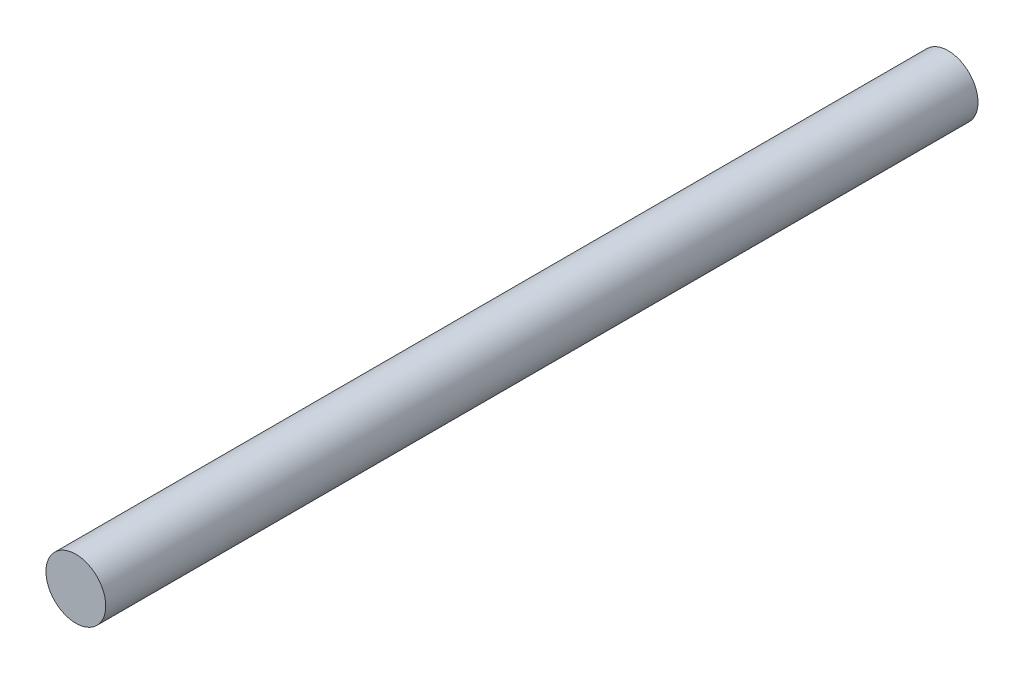
ISO-10303-21;
HEADER;
FILE_DESCRIPTION(('STEP AP214'),'2;1');
FILE_NAME('part.step','',(''),(''),'','','');
FILE_SCHEMA(('AUTOMOTIVE_DESIGN { 1 0 10303 214 1 1 1 1 }'));
ENDSEC;
DATA;
#1=APPLICATION_CONTEXT('core data for automotive mechanical design processes');
#2=APPLICATION_PROTOCOL_DEFINITION('international standard','automotive_design',2000,#1);
#3=PRODUCT_CONTEXT('',#1,'mechanical');
#4=PRODUCT('Part','Part','',(#3));
#5=PRODUCT_RELATED_PRODUCT_CATEGORY('part','',(#4));
#6=PRODUCT_DEFINITION_FORMATION('','',#4);
#7=PRODUCT_DEFINITION_CONTEXT('part definition',#1,'design');
#8=PRODUCT_DEFINITION('design','',#6,#7);
#9=PRODUCT_DEFINITION_SHAPE('','',#8);
#10=(LENGTH_UNIT() NAMED_UNIT(*) SI_UNIT(.MILLI.,.METRE.));
#11=(NAMED_UNIT(*) PLANE_ANGLE_UNIT() SI_UNIT($,.RADIAN.));
#12=(NAMED_UNIT(*) SI_UNIT($,.STERADIAN.) SOLID_ANGLE_UNIT());
#13=UNCERTAINTY_MEASURE_WITH_UNIT(LENGTH_MEASURE(1.E-05),#10,'distance_accuracy_value','');
#14=(GEOMETRIC_REPRESENTATION_CONTEXT(3) GLOBAL_UNCERTAINTY_ASSIGNED_CONTEXT((#13)) GLOBAL_UNIT_ASSIGNED_CONTEXT((#10,
#11,#12)) REPRESENTATION_CONTEXT('',''));
#15=CARTESIAN_POINT('',(0.,0.,0.));
#16=DIRECTION('',(0.,0.,1.));
#17=DIRECTION('',(1.,0.,0.));
#18=AXIS2_PLACEMENT_3D('',#15,#16,#17);
#19=CARTESIAN_POINT('',(0.,0.,175.));
#20=DIRECTION('',(0.,0.,-1.));
#21=DIRECTION('',(-1.,0.,0.));
#22=AXIS2_PLACEMENT_3D('',#19,#20,#21);
#23=CYLINDRICAL_SURFACE('',#22,6.);
#24=CARTESIAN_POINT('',(0.,0.,175.));
#25=DIRECTION('',(0.,0.,1.));
#26=DIRECTION('',(1.,0.,0.));
#27=AXIS2_PLACEMENT_3D('',#24,#25,#26);
#28=CIRCLE('',#27,6.);
#29=CARTESIAN_POINT('',(6.,0.,175.));
#30=VERTEX_POINT('',#29);
#31=EDGE_CURVE('E10',#30,#30,#28,.T.);
#32=ORIENTED_EDGE('',*,*,#31,.F.);
#33=EDGE_LOOP('',(#32));
#34=FACE_BOUND('',#33,.T.);
#35=CARTESIAN_POINT('',(0.,0.,0.));
#36=DIRECTION('',(0.,0.,1.));
#37=DIRECTION('',(1.,0.,0.));
#38=AXIS2_PLACEMENT_3D('',#35,#36,#37);
#39=CIRCLE('',#38,6.);
#40=CARTESIAN_POINT('',(6.,0.,0.));
#41=VERTEX_POINT('',#40);
#42=EDGE_CURVE('E40',#41,#41,#39,.T.);
#43=ORIENTED_EDGE('',*,*,#42,.T.);
#44=EDGE_LOOP('',(#43));
#45=FACE_BOUND('',#44,.T.);
#46=ADVANCED_FACE('F37',(#34,#45),#23,.T.);
#47=CARTESIAN_POINT('',(0.,0.,175.));
#48=DIRECTION('',(0.,0.,1.));
#49=DIRECTION('',(1.,0.,0.));
#50=AXIS2_PLACEMENT_3D('',#47,#48,#49);
#51=PLANE('',#50);
#52=ORIENTED_EDGE('',*,*,#31,.T.);
#53=EDGE_LOOP('',(#52));
#54=FACE_BOUND('',#53,.T.);
#55=ADVANCED_FACE('F54',(#54),#51,.T.);
#56=CARTESIAN_POINT('',(0.,0.,0.));
#57=DIRECTION('',(0.,0.,1.));
#58=DIRECTION('',(1.,0.,0.));
#59=AXIS2_PLACEMENT_3D('',#56,#57,#58);
#60=PLANE('',#59);
#61=ORIENTED_EDGE('',*,*,#42,.F.);
#62=EDGE_LOOP('',(#61));
#63=FACE_BOUND('',#62,.T.);
#64=ADVANCED_FACE('F52',(#63),#60,.F.);
#65=CLOSED_SHELL('',(#46,#55,#64));
#66=MANIFOLD_SOLID_BREP('B2',#65);
#67=ADVANCED_BREP_SHAPE_REPRESENTATION('',(#18,#66),#14);
#68=SHAPE_DEFINITION_REPRESENTATION(#9,#67);
ENDSEC;
END-ISO-10303-21;
